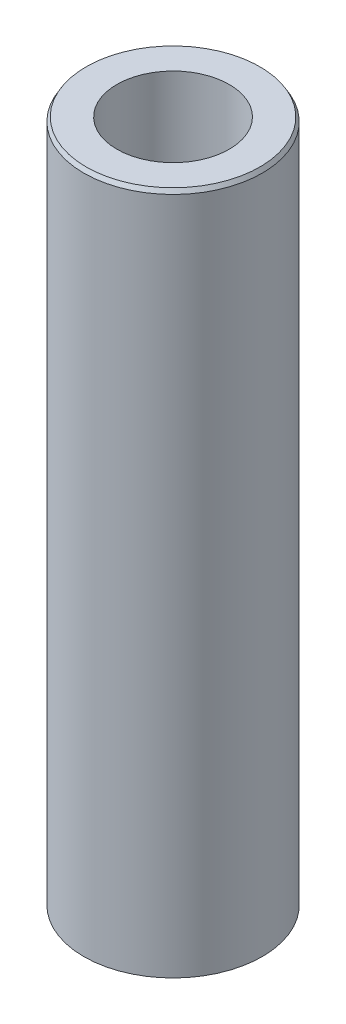
ISO-10303-21;
HEADER;
FILE_DESCRIPTION(('STEP AP214'),'2;1');
FILE_NAME('part.step','',(''),(''),'','','');
FILE_SCHEMA(('AUTOMOTIVE_DESIGN { 1 0 10303 214 1 1 1 1 }'));
ENDSEC;
DATA;
#1=APPLICATION_CONTEXT('core data for automotive mechanical design processes');
#2=APPLICATION_PROTOCOL_DEFINITION('international standard','automotive_design',2000,#1);
#3=PRODUCT_CONTEXT('',#1,'mechanical');
#4=PRODUCT('Part','Part','',(#3));
#5=PRODUCT_RELATED_PRODUCT_CATEGORY('part','',(#4));
#6=PRODUCT_DEFINITION_FORMATION('','',#4);
#7=PRODUCT_DEFINITION_CONTEXT('part definition',#1,'design');
#8=PRODUCT_DEFINITION('design','',#6,#7);
#9=PRODUCT_DEFINITION_SHAPE('','',#8);
#10=(LENGTH_UNIT() NAMED_UNIT(*) SI_UNIT(.MILLI.,.METRE.));
#11=(NAMED_UNIT(*) PLANE_ANGLE_UNIT() SI_UNIT($,.RADIAN.));
#12=(NAMED_UNIT(*) SI_UNIT($,.STERADIAN.) SOLID_ANGLE_UNIT());
#13=UNCERTAINTY_MEASURE_WITH_UNIT(LENGTH_MEASURE(1.E-05),#10,'distance_accuracy_value','');
#14=(GEOMETRIC_REPRESENTATION_CONTEXT(3) GLOBAL_UNCERTAINTY_ASSIGNED_CONTEXT((#13)) GLOBAL_UNIT_ASSIGNED_CONTEXT((#10,
#11,#12)) REPRESENTATION_CONTEXT('',''));
#15=CARTESIAN_POINT('',(0.,0.,0.));
#16=DIRECTION('',(0.,0.,1.));
#17=DIRECTION('',(1.,0.,0.));
#18=AXIS2_PLACEMENT_3D('',#15,#16,#17);
#19=CARTESIAN_POINT('',(0.,403.043581230175,0.));
#20=DIRECTION('',(0.,-1.,0.));
#21=DIRECTION('',(0.,0.,-1.));
#22=AXIS2_PLACEMENT_3D('',#19,#20,#21);
#23=CYLINDRICAL_SURFACE('',#22,52.5);
#24=CARTESIAN_POINT('',(0.,400.607902310272,0.));
#25=DIRECTION('',(0.,1.,0.));
#26=DIRECTION('',(0.,0.,1.));
#27=AXIS2_PLACEMENT_3D('',#24,#25,#26);
#28=CIRCLE('',#27,52.5);
#29=CARTESIAN_POINT('',(0.,400.607902310272,52.5));
#30=VERTEX_POINT('',#29);
#31=EDGE_CURVE('E50',#30,#30,#28,.F.);
#32=ORIENTED_EDGE('',*,*,#31,.T.);
#33=EDGE_LOOP('',(#32));
#34=FACE_BOUND('',#33,.T.);
#35=CARTESIAN_POINT('',(0.,1.40623988006527,0.));
#36=DIRECTION('',(0.,1.,0.));
#37=DIRECTION('',(0.,0.,1.));
#38=AXIS2_PLACEMENT_3D('',#35,#36,#37);
#39=CIRCLE('',#38,52.5);
#40=CARTESIAN_POINT('',(0.,1.40623988006527,52.5));
#41=VERTEX_POINT('',#40);
#42=EDGE_CURVE('E51',#41,#41,#39,.T.);
#43=ORIENTED_EDGE('',*,*,#42,.T.);
#44=EDGE_LOOP('',(#43));
#45=FACE_BOUND('',#44,.T.);
#46=ADVANCED_FACE('F39',(#34,#45),#23,.T.);
#47=CARTESIAN_POINT('',(0.,403.043581230175,0.));
#48=DIRECTION('',(0.,1.,0.));
#49=DIRECTION('',(0.,0.,1.));
#50=AXIS2_PLACEMENT_3D('',#47,#48,#49);
#51=PLANE('',#50);
#52=CARTESIAN_POINT('',(0.,403.043581230175,0.));
#53=DIRECTION('',(0.,1.,0.));
#54=DIRECTION('',(0.,0.,1.));
#55=AXIS2_PLACEMENT_3D('',#52,#53,#54);
#56=CIRCLE('',#55,51.0937601199347);
#57=CARTESIAN_POINT('',(0.,403.043581230175,51.0937601199347));
#58=VERTEX_POINT('',#57);
#59=EDGE_CURVE('E54',#58,#58,#56,.T.);
#60=ORIENTED_EDGE('',*,*,#59,.T.);
#61=EDGE_LOOP('',(#60));
#62=FACE_BOUND('',#61,.T.);
#63=CARTESIAN_POINT('',(0.,403.043581230175,0.));
#64=DIRECTION('',(0.,1.,0.));
#65=DIRECTION('',(0.,0.,1.));
#66=AXIS2_PLACEMENT_3D('',#63,#64,#65);
#67=CIRCLE('',#66,33.0450585252489);
#68=CARTESIAN_POINT('',(0.,403.043581230175,33.0450585252489));
#69=VERTEX_POINT('',#68);
#70=EDGE_CURVE('E58',#69,#69,#67,.T.);
#71=ORIENTED_EDGE('',*,*,#70,.F.);
#72=EDGE_LOOP('',(#71));
#73=FACE_BOUND('',#72,.T.);
#74=ADVANCED_FACE('F69',(#62,#73),#51,.T.);
#75=CARTESIAN_POINT('',(0.,0.,0.));
#76=DIRECTION('',(0.,1.,0.));
#77=DIRECTION('',(0.,0.,1.));
#78=AXIS2_PLACEMENT_3D('',#75,#76,#77);
#79=PLANE('',#78);
#80=CARTESIAN_POINT('',(0.,0.,0.));
#81=DIRECTION('',(0.,1.,0.));
#82=DIRECTION('',(0.,0.,1.));
#83=AXIS2_PLACEMENT_3D('',#80,#81,#82);
#84=CIRCLE('',#83,50.0643210800973);
#85=CARTESIAN_POINT('',(0.,0.,50.0643210800973));
#86=VERTEX_POINT('',#85);
#87=EDGE_CURVE('E10',#86,#86,#84,.F.);
#88=ORIENTED_EDGE('',*,*,#87,.T.);
#89=EDGE_LOOP('',(#88));
#90=FACE_BOUND('',#89,.T.);
#91=CARTESIAN_POINT('',(0.,0.,0.));
#92=DIRECTION('',(0.,1.,0.));
#93=DIRECTION('',(0.,0.,1.));
#94=AXIS2_PLACEMENT_3D('',#91,#92,#93);
#95=CIRCLE('',#94,33.0450585252489);
#96=CARTESIAN_POINT('',(0.,0.,33.0450585252489));
#97=VERTEX_POINT('',#96);
#98=EDGE_CURVE('E63',#97,#97,#95,.T.);
#99=ORIENTED_EDGE('',*,*,#98,.T.);
#100=EDGE_LOOP('',(#99));
#101=FACE_BOUND('',#100,.T.);
#102=ADVANCED_FACE('F75',(#90,#101),#79,.F.);
#103=CARTESIAN_POINT('',(0.,403.043581230175,0.));
#104=DIRECTION('',(0.,-1.,0.));
#105=DIRECTION('',(0.,0.,-1.));
#106=AXIS2_PLACEMENT_3D('',#103,#104,#105);
#107=CYLINDRICAL_SURFACE('',#106,33.0450585252489);
#108=ORIENTED_EDGE('',*,*,#70,.T.);
#109=EDGE_LOOP('',(#108));
#110=FACE_BOUND('',#109,.T.);
#111=ORIENTED_EDGE('',*,*,#98,.F.);
#112=EDGE_LOOP('',(#111));
#113=FACE_BOUND('',#112,.T.);
#114=ADVANCED_FACE('F70',(#110,#113),#107,.F.);
#115=CARTESIAN_POINT('',(0.,403.043581230175,0.));
#116=DIRECTION('',(0.,-1.,0.));
#117=DIRECTION('',(0.,0.,-1.));
#118=AXIS2_PLACEMENT_3D('',#115,#116,#117);
#119=CONICAL_SURFACE('',#118,51.0937601199347,0.523598775598294);
#120=ORIENTED_EDGE('',*,*,#31,.F.);
#121=EDGE_LOOP('',(#120));
#122=FACE_BOUND('',#121,.T.);
#123=ORIENTED_EDGE('',*,*,#59,.F.);
#124=EDGE_LOOP('',(#123));
#125=FACE_BOUND('',#124,.T.);
#126=ADVANCED_FACE('F81',(#122,#125),#119,.T.);
#127=CARTESIAN_POINT('',(0.,1.40623988006527,0.));
#128=DIRECTION('',(0.,1.,0.));
#129=DIRECTION('',(0.,0.,1.));
#130=AXIS2_PLACEMENT_3D('',#127,#128,#129);
#131=CONICAL_SURFACE('',#130,52.5,1.04719755119661);
#132=ORIENTED_EDGE('',*,*,#87,.F.);
#133=EDGE_LOOP('',(#132));
#134=FACE_BOUND('',#133,.T.);
#135=ORIENTED_EDGE('',*,*,#42,.F.);
#136=EDGE_LOOP('',(#135));
#137=FACE_BOUND('',#136,.T.);
#138=ADVANCED_FACE('F45',(#134,#137),#131,.T.);
#139=CLOSED_SHELL('',(#46,#74,#102,#114,#126,#138));
#140=MANIFOLD_SOLID_BREP('B2',#139);
#141=ADVANCED_BREP_SHAPE_REPRESENTATION('',(#18,#140),#14);
#142=SHAPE_DEFINITION_REPRESENTATION(#9,#141);
ENDSEC;
END-ISO-10303-21;
